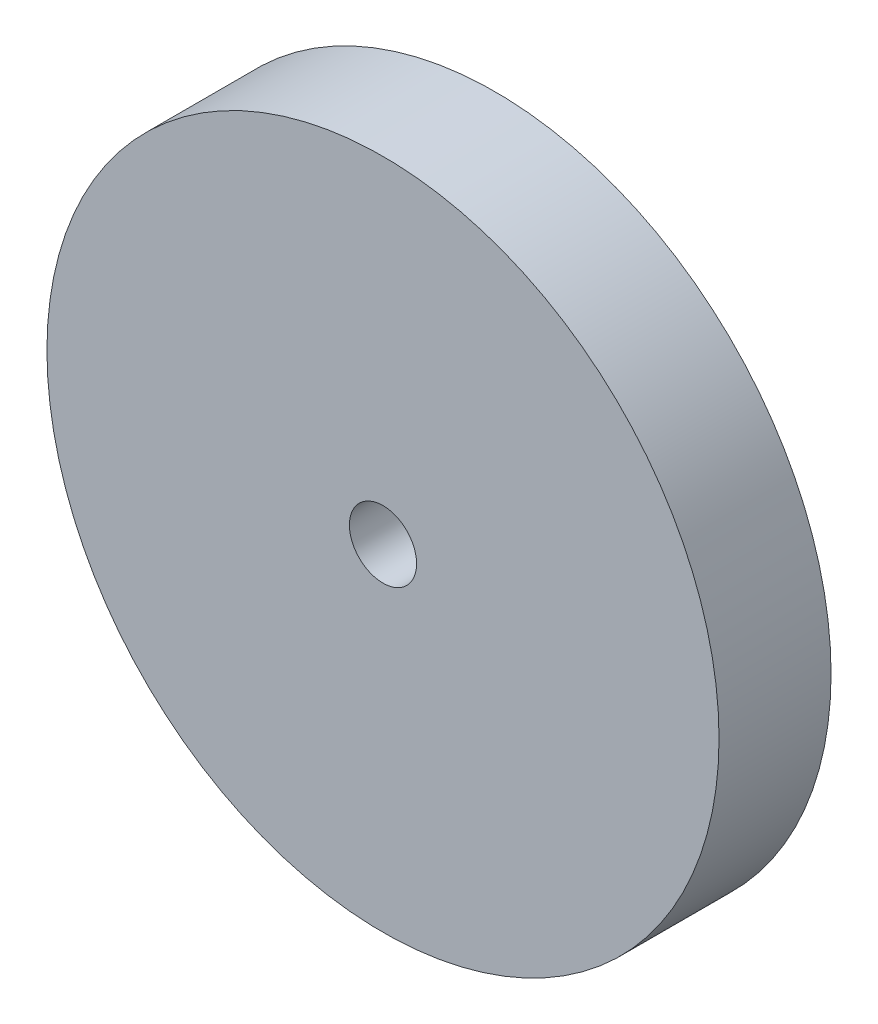
ISO-10303-21;
HEADER;
FILE_DESCRIPTION(('STEP AP214'),'2;1');
FILE_NAME('part.step','',(''),(''),'','','');
FILE_SCHEMA(('AUTOMOTIVE_DESIGN { 1 0 10303 214 1 1 1 1 }'));
ENDSEC;
DATA;
#1=APPLICATION_CONTEXT('core data for automotive mechanical design processes');
#2=APPLICATION_PROTOCOL_DEFINITION('international standard','automotive_design',2000,#1);
#3=PRODUCT_CONTEXT('',#1,'mechanical');
#4=PRODUCT('Part','Part','',(#3));
#5=PRODUCT_RELATED_PRODUCT_CATEGORY('part','',(#4));
#6=PRODUCT_DEFINITION_FORMATION('','',#4);
#7=PRODUCT_DEFINITION_CONTEXT('part definition',#1,'design');
#8=PRODUCT_DEFINITION('design','',#6,#7);
#9=PRODUCT_DEFINITION_SHAPE('','',#8);
#10=(LENGTH_UNIT() NAMED_UNIT(*) SI_UNIT(.MILLI.,.METRE.));
#11=(NAMED_UNIT(*) PLANE_ANGLE_UNIT() SI_UNIT($,.RADIAN.));
#12=(NAMED_UNIT(*) SI_UNIT($,.STERADIAN.) SOLID_ANGLE_UNIT());
#13=UNCERTAINTY_MEASURE_WITH_UNIT(LENGTH_MEASURE(1.E-05),#10,'distance_accuracy_value','');
#14=(GEOMETRIC_REPRESENTATION_CONTEXT(3) GLOBAL_UNCERTAINTY_ASSIGNED_CONTEXT((#13)) GLOBAL_UNIT_ASSIGNED_CONTEXT((#10,
#11,#12)) REPRESENTATION_CONTEXT('',''));
#15=CARTESIAN_POINT('',(0.,0.,0.));
#16=DIRECTION('',(0.,0.,1.));
#17=DIRECTION('',(1.,0.,0.));
#18=AXIS2_PLACEMENT_3D('',#15,#16,#17);
#19=CARTESIAN_POINT('',(0.,0.,20.));
#20=DIRECTION('',(0.,0.,-1.));
#21=DIRECTION('',(-1.,0.,0.));
#22=AXIS2_PLACEMENT_3D('',#19,#20,#21);
#23=CYLINDRICAL_SURFACE('',#22,60.);
#24=CARTESIAN_POINT('',(0.,0.,20.));
#25=DIRECTION('',(0.,0.,1.));
#26=DIRECTION('',(1.,0.,0.));
#27=AXIS2_PLACEMENT_3D('',#24,#25,#26);
#28=CIRCLE('',#27,60.);
#29=CARTESIAN_POINT('',(60.,0.,20.));
#30=VERTEX_POINT('',#29);
#31=EDGE_CURVE('E10',#30,#30,#28,.T.);
#32=ORIENTED_EDGE('',*,*,#31,.F.);
#33=EDGE_LOOP('',(#32));
#34=FACE_BOUND('',#33,.T.);
#35=CARTESIAN_POINT('',(0.,0.,0.));
#36=DIRECTION('',(0.,0.,1.));
#37=DIRECTION('',(1.,0.,0.));
#38=AXIS2_PLACEMENT_3D('',#35,#36,#37);
#39=CIRCLE('',#38,60.);
#40=CARTESIAN_POINT('',(60.,0.,0.));
#41=VERTEX_POINT('',#40);
#42=EDGE_CURVE('E36',#41,#41,#39,.T.);
#43=ORIENTED_EDGE('',*,*,#42,.T.);
#44=EDGE_LOOP('',(#43));
#45=FACE_BOUND('',#44,.T.);
#46=ADVANCED_FACE('F33',(#34,#45),#23,.T.);
#47=CARTESIAN_POINT('',(0.,0.,20.));
#48=DIRECTION('',(0.,0.,1.));
#49=DIRECTION('',(1.,0.,0.));
#50=AXIS2_PLACEMENT_3D('',#47,#48,#49);
#51=PLANE('',#50);
#52=CARTESIAN_POINT('',(0.,0.,20.));
#53=DIRECTION('',(0.,0.,1.));
#54=DIRECTION('',(1.,0.,0.));
#55=AXIS2_PLACEMENT_3D('',#52,#53,#54);
#56=CIRCLE('',#55,6.);
#57=CARTESIAN_POINT('',(6.,0.,20.));
#58=VERTEX_POINT('',#57);
#59=EDGE_CURVE('E45',#58,#58,#56,.T.);
#60=ORIENTED_EDGE('',*,*,#59,.F.);
#61=EDGE_LOOP('',(#60));
#62=FACE_BOUND('',#61,.T.);
#63=ORIENTED_EDGE('',*,*,#31,.T.);
#64=EDGE_LOOP('',(#63));
#65=FACE_BOUND('',#64,.T.);
#66=ADVANCED_FACE('F60',(#62,#65),#51,.T.);
#67=CARTESIAN_POINT('',(0.,0.,0.));
#68=DIRECTION('',(0.,0.,1.));
#69=DIRECTION('',(1.,0.,0.));
#70=AXIS2_PLACEMENT_3D('',#67,#68,#69);
#71=PLANE('',#70);
#72=CARTESIAN_POINT('',(0.,0.,0.));
#73=DIRECTION('',(0.,0.,1.));
#74=DIRECTION('',(1.,0.,0.));
#75=AXIS2_PLACEMENT_3D('',#72,#73,#74);
#76=CIRCLE('',#75,6.);
#77=CARTESIAN_POINT('',(6.,0.,0.));
#78=VERTEX_POINT('',#77);
#79=EDGE_CURVE('E43',#78,#78,#76,.T.);
#80=ORIENTED_EDGE('',*,*,#79,.T.);
#81=EDGE_LOOP('',(#80));
#82=FACE_BOUND('',#81,.T.);
#83=ORIENTED_EDGE('',*,*,#42,.F.);
#84=EDGE_LOOP('',(#83));
#85=FACE_BOUND('',#84,.T.);
#86=ADVANCED_FACE('F51',(#82,#85),#71,.F.);
#87=CARTESIAN_POINT('',(0.,0.,0.));
#88=DIRECTION('',(0.,0.,1.));
#89=DIRECTION('',(1.,0.,0.));
#90=AXIS2_PLACEMENT_3D('',#87,#88,#89);
#91=CYLINDRICAL_SURFACE('',#90,6.);
#92=ORIENTED_EDGE('',*,*,#79,.F.);
#93=EDGE_LOOP('',(#92));
#94=FACE_BOUND('',#93,.T.);
#95=ORIENTED_EDGE('',*,*,#59,.T.);
#96=EDGE_LOOP('',(#95));
#97=FACE_BOUND('',#96,.T.);
#98=ADVANCED_FACE('F54',(#94,#97),#91,.F.);
#99=CLOSED_SHELL('',(#46,#66,#86,#98));
#100=MANIFOLD_SOLID_BREP('B2',#99);
#101=ADVANCED_BREP_SHAPE_REPRESENTATION('',(#18,#100),#14);
#102=SHAPE_DEFINITION_REPRESENTATION(#9,#101);
ENDSEC;
END-ISO-10303-21;
